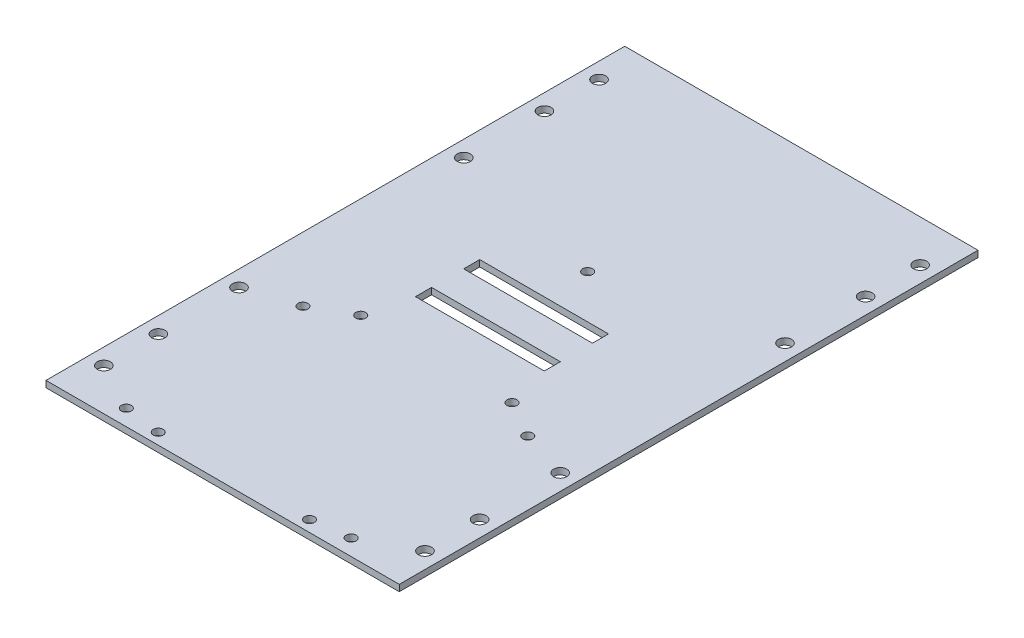
ISO-10303-21;
HEADER;
FILE_DESCRIPTION(('STEP AP214'),'2;1');
FILE_NAME('part.step','',(''),(''),'','','');
FILE_SCHEMA(('AUTOMOTIVE_DESIGN { 1 0 10303 214 1 1 1 1 }'));
ENDSEC;
DATA;
#1=APPLICATION_CONTEXT('core data for automotive mechanical design processes');
#2=APPLICATION_PROTOCOL_DEFINITION('international standard','automotive_design',2000,#1);
#3=PRODUCT_CONTEXT('',#1,'mechanical');
#4=PRODUCT('Part','Part','',(#3));
#5=PRODUCT_RELATED_PRODUCT_CATEGORY('part','',(#4));
#6=PRODUCT_DEFINITION_FORMATION('','',#4);
#7=PRODUCT_DEFINITION_CONTEXT('part definition',#1,'design');
#8=PRODUCT_DEFINITION('design','',#6,#7);
#9=PRODUCT_DEFINITION_SHAPE('','',#8);
#10=(LENGTH_UNIT() NAMED_UNIT(*) SI_UNIT(.MILLI.,.METRE.));
#11=(NAMED_UNIT(*) PLANE_ANGLE_UNIT() SI_UNIT($,.RADIAN.));
#12=(NAMED_UNIT(*) SI_UNIT($,.STERADIAN.) SOLID_ANGLE_UNIT());
#13=UNCERTAINTY_MEASURE_WITH_UNIT(LENGTH_MEASURE(1.E-05),#10,'distance_accuracy_value','');
#14=(GEOMETRIC_REPRESENTATION_CONTEXT(3) GLOBAL_UNCERTAINTY_ASSIGNED_CONTEXT((#13)) GLOBAL_UNIT_ASSIGNED_CONTEXT((#10,
#11,#12)) REPRESENTATION_CONTEXT('',''));
#15=CARTESIAN_POINT('',(0.,0.,0.));
#16=DIRECTION('',(0.,0.,1.));
#17=DIRECTION('',(1.,0.,0.));
#18=AXIS2_PLACEMENT_3D('',#15,#16,#17);
#19=CARTESIAN_POINT('',(0.,2.,0.));
#20=DIRECTION('',(0.,-1.,0.));
#21=DIRECTION('',(0.,0.,-1.));
#22=AXIS2_PLACEMENT_3D('',#19,#20,#21);
#23=PLANE('',#22);
#24=CARTESIAN_POINT('',(-1.01307850997046E-12,2.,-23.5500000000006));
#25=DIRECTION('',(0.,1.,0.));
#26=DIRECTION('',(0.,0.,1.));
#27=AXIS2_PLACEMENT_3D('',#24,#25,#26);
#28=CIRCLE('',#27,1.55);
#29=CARTESIAN_POINT('',(-1.01307850997046E-12,2.,-22.0000000000006));
#30=VERTEX_POINT('',#29);
#31=EDGE_CURVE('E536',#30,#30,#28,.T.);
#32=ORIENTED_EDGE('',*,*,#31,.F.);
#33=EDGE_LOOP('',(#32));
#34=FACE_BOUND('',#33,.T.);
#35=CARTESIAN_POINT('',(35.,2.,85.1));
#36=DIRECTION('',(0.,1.,0.));
#37=DIRECTION('',(0.,0.,1.));
#38=AXIS2_PLACEMENT_3D('',#35,#36,#37);
#39=CIRCLE('',#38,1.55);
#40=CARTESIAN_POINT('',(35.,2.,86.65));
#41=VERTEX_POINT('',#40);
#42=EDGE_CURVE('E538',#41,#41,#39,.T.);
#43=ORIENTED_EDGE('',*,*,#42,.F.);
#44=EDGE_LOOP('',(#43));
#45=FACE_BOUND('',#44,.T.);
#46=CARTESIAN_POINT('',(35.,2.,30.1));
#47=DIRECTION('',(0.,1.,0.));
#48=DIRECTION('',(0.,0.,1.));
#49=AXIS2_PLACEMENT_3D('',#46,#47,#48);
#50=CIRCLE('',#49,1.55);
#51=CARTESIAN_POINT('',(35.,2.,31.65));
#52=VERTEX_POINT('',#51);
#53=EDGE_CURVE('E541',#52,#52,#50,.T.);
#54=ORIENTED_EDGE('',*,*,#53,.F.);
#55=EDGE_LOOP('',(#54));
#56=FACE_BOUND('',#55,.T.);
#57=CARTESIAN_POINT('',(-35.,2.,85.1));
#58=DIRECTION('',(0.,1.,0.));
#59=DIRECTION('',(0.,0.,1.));
#60=AXIS2_PLACEMENT_3D('',#57,#58,#59);
#61=CIRCLE('',#60,1.55);
#62=CARTESIAN_POINT('',(-35.,2.,86.65));
#63=VERTEX_POINT('',#62);
#64=EDGE_CURVE('E544',#63,#63,#61,.T.);
#65=ORIENTED_EDGE('',*,*,#64,.F.);
#66=EDGE_LOOP('',(#65));
#67=FACE_BOUND('',#66,.T.);
#68=CARTESIAN_POINT('',(-23.5500000000008,2.,23.5499999999994));
#69=DIRECTION('',(0.,1.,0.));
#70=DIRECTION('',(0.,0.,1.));
#71=AXIS2_PLACEMENT_3D('',#68,#69,#70);
#72=CIRCLE('',#71,1.55);
#73=CARTESIAN_POINT('',(-23.5500000000008,2.,25.0999999999994));
#74=VERTEX_POINT('',#73);
#75=EDGE_CURVE('E527',#74,#74,#72,.T.);
#76=ORIENTED_EDGE('',*,*,#75,.F.);
#77=EDGE_LOOP('',(#76));
#78=FACE_BOUND('',#77,.T.);
#79=CARTESIAN_POINT('',(23.5499999999992,2.,86.5999999999997));
#80=DIRECTION('',(0.,1.,0.));
#81=DIRECTION('',(0.,0.,1.));
#82=AXIS2_PLACEMENT_3D('',#79,#80,#81);
#83=CIRCLE('',#82,1.55);
#84=CARTESIAN_POINT('',(23.5499999999992,2.,88.1499999999997));
#85=VERTEX_POINT('',#84);
#86=EDGE_CURVE('E524',#85,#85,#83,.T.);
#87=ORIENTED_EDGE('',*,*,#86,.F.);
#88=EDGE_LOOP('',(#87));
#89=FACE_BOUND('',#88,.T.);
#90=CARTESIAN_POINT('',(-23.5500000000008,2.,86.5999999999997));
#91=DIRECTION('',(0.,1.,0.));
#92=DIRECTION('',(0.,0.,1.));
#93=AXIS2_PLACEMENT_3D('',#90,#91,#92);
#94=CIRCLE('',#93,1.55);
#95=CARTESIAN_POINT('',(-23.5500000000008,2.,88.1499999999997));
#96=VERTEX_POINT('',#95);
#97=EDGE_CURVE('E526',#96,#96,#94,.T.);
#98=ORIENTED_EDGE('',*,*,#97,.F.);
#99=EDGE_LOOP('',(#98));
#100=FACE_BOUND('',#99,.T.);
#101=CARTESIAN_POINT('',(23.5499999999992,2.,23.5499999999994));
#102=DIRECTION('',(0.,1.,0.));
#103=DIRECTION('',(0.,0.,1.));
#104=AXIS2_PLACEMENT_3D('',#101,#102,#103);
#105=CIRCLE('',#104,1.55);
#106=CARTESIAN_POINT('',(23.5499999999992,2.,25.0999999999994));
#107=VERTEX_POINT('',#106);
#108=EDGE_CURVE('E530',#107,#107,#105,.T.);
#109=ORIENTED_EDGE('',*,*,#108,.F.);
#110=EDGE_LOOP('',(#109));
#111=FACE_BOUND('',#110,.T.);
#112=CARTESIAN_POINT('',(-35.,2.,30.1));
#113=DIRECTION('',(0.,1.,0.));
#114=DIRECTION('',(0.,0.,1.));
#115=AXIS2_PLACEMENT_3D('',#112,#113,#114);
#116=CIRCLE('',#115,1.55);
#117=CARTESIAN_POINT('',(-35.,2.,31.65));
#118=VERTEX_POINT('',#117);
#119=EDGE_CURVE('E302',#118,#118,#116,.T.);
#120=ORIENTED_EDGE('',*,*,#119,.F.);
#121=EDGE_LOOP('',(#120));
#122=FACE_BOUND('',#121,.T.);
#123=DIRECTION('',(1.,0.,0.));
#124=VECTOR('',#123,1.);
#125=CARTESIAN_POINT('',(-20.05,2.,-5.));
#126=LINE('',#125,#124);
#127=CARTESIAN_POINT('',(-20.05,2.,-5.));
#128=VERTEX_POINT('',#127);
#129=CARTESIAN_POINT('',(20.05,2.,-5.00000000000001));
#130=VERTEX_POINT('',#129);
#131=EDGE_CURVE('E148',#128,#130,#126,.T.);
#132=ORIENTED_EDGE('',*,*,#131,.F.);
#133=DIRECTION('',(0.,0.,1.));
#134=VECTOR('',#133,1.);
#135=CARTESIAN_POINT('',(-20.05,2.,-9.99999999999999));
#136=LINE('',#135,#134);
#137=CARTESIAN_POINT('',(-20.05,2.,-9.99999999999999));
#138=VERTEX_POINT('',#137);
#139=EDGE_CURVE('E58',#138,#128,#136,.T.);
#140=ORIENTED_EDGE('',*,*,#139,.F.);
#141=DIRECTION('',(-1.,0.,0.));
#142=VECTOR('',#141,1.);
#143=CARTESIAN_POINT('',(20.05,2.,-10.));
#144=LINE('',#143,#142);
#145=CARTESIAN_POINT('',(20.05,2.,-10.));
#146=VERTEX_POINT('',#145);
#147=EDGE_CURVE('E154',#146,#138,#144,.T.);
#148=ORIENTED_EDGE('',*,*,#147,.F.);
#149=DIRECTION('',(0.,0.,-1.));
#150=VECTOR('',#149,1.);
#151=CARTESIAN_POINT('',(20.05,2.,-5.00000000000001));
#152=LINE('',#151,#150);
#153=EDGE_CURVE('E138',#130,#146,#152,.T.);
#154=ORIENTED_EDGE('',*,*,#153,.F.);
#155=EDGE_LOOP('',(#132,#140,#148,#154));
#156=FACE_BOUND('',#155,.T.);
#157=DIRECTION('',(-1.,0.,0.));
#158=VECTOR('',#157,1.);
#159=CARTESIAN_POINT('',(-20.05,2.,5.00000000000001));
#160=LINE('',#159,#158);
#161=CARTESIAN_POINT('',(20.05,2.,5.));
#162=VERTEX_POINT('',#161);
#163=CARTESIAN_POINT('',(-20.05,2.,5.00000000000001));
#164=VERTEX_POINT('',#163);
#165=EDGE_CURVE('E178',#162,#164,#160,.T.);
#166=ORIENTED_EDGE('',*,*,#165,.F.);
#167=DIRECTION('',(0.,0.,-1.));
#168=VECTOR('',#167,1.);
#169=CARTESIAN_POINT('',(20.05,2.,10.));
#170=LINE('',#169,#168);
#171=CARTESIAN_POINT('',(20.05,2.,10.));
#172=VERTEX_POINT('',#171);
#173=EDGE_CURVE('E66',#172,#162,#170,.T.);
#174=ORIENTED_EDGE('',*,*,#173,.F.);
#175=DIRECTION('',(1.,0.,0.));
#176=VECTOR('',#175,1.);
#177=CARTESIAN_POINT('',(-20.05,2.,10.));
#178=LINE('',#177,#176);
#179=CARTESIAN_POINT('',(-20.05,2.,10.));
#180=VERTEX_POINT('',#179);
#181=EDGE_CURVE('E166',#180,#172,#178,.T.);
#182=ORIENTED_EDGE('',*,*,#181,.F.);
#183=DIRECTION('',(0.,0.,1.));
#184=VECTOR('',#183,1.);
#185=CARTESIAN_POINT('',(-20.05,2.,5.00000000000001));
#186=LINE('',#185,#184);
#187=EDGE_CURVE('E175',#164,#180,#186,.T.);
#188=ORIENTED_EDGE('',*,*,#187,.F.);
#189=EDGE_LOOP('',(#166,#174,#182,#188));
#190=FACE_BOUND('',#189,.T.);
#191=DIRECTION('',(-1.,0.,0.));
#192=VECTOR('',#191,1.);
#193=CARTESIAN_POINT('',(0.,2.,-90.1));
#194=LINE('',#193,#192);
#195=CARTESIAN_POINT('',(55.,2.,-90.1));
#196=VERTEX_POINT('',#195);
#197=CARTESIAN_POINT('',(-55.,2.,-90.1));
#198=VERTEX_POINT('',#197);
#199=EDGE_CURVE('E277',#196,#198,#194,.T.);
#200=ORIENTED_EDGE('',*,*,#199,.T.);
#201=DIRECTION('',(0.,0.,-1.));
#202=VECTOR('',#201,1.);
#203=CARTESIAN_POINT('',(-55.,2.,0.));
#204=LINE('',#203,#202);
#205=CARTESIAN_POINT('',(-55.,2.,90.1));
#206=VERTEX_POINT('',#205);
#207=EDGE_CURVE('E248',#206,#198,#204,.T.);
#208=ORIENTED_EDGE('',*,*,#207,.F.);
#209=DIRECTION('',(-1.,0.,0.));
#210=VECTOR('',#209,1.);
#211=CARTESIAN_POINT('',(0.,2.,90.1));
#212=LINE('',#211,#210);
#213=CARTESIAN_POINT('',(55.,2.,90.1));
#214=VERTEX_POINT('',#213);
#215=EDGE_CURVE('E221',#214,#206,#212,.T.);
#216=ORIENTED_EDGE('',*,*,#215,.F.);
#217=DIRECTION('',(0.,0.,-1.));
#218=VECTOR('',#217,1.);
#219=CARTESIAN_POINT('',(55.,2.,0.));
#220=LINE('',#219,#218);
#221=EDGE_CURVE('E275',#214,#196,#220,.T.);
#222=ORIENTED_EDGE('',*,*,#221,.T.);
#223=EDGE_LOOP('',(#200,#208,#216,#222));
#224=FACE_BOUND('',#223,.T.);
#225=CARTESIAN_POINT('',(50.,2.,-77.1));
#226=DIRECTION('',(0.,1.,0.));
#227=DIRECTION('',(0.,0.,1.));
#228=AXIS2_PLACEMENT_3D('',#225,#226,#227);
#229=CIRCLE('',#228,2.04999999999999);
#230=CARTESIAN_POINT('',(50.,2.,-75.05));
#231=VERTEX_POINT('',#230);
#232=EDGE_CURVE('E269',#231,#231,#229,.T.);
#233=ORIENTED_EDGE('',*,*,#232,.F.);
#234=EDGE_LOOP('',(#233));
#235=FACE_BOUND('',#234,.T.);
#236=CARTESIAN_POINT('',(50.,2.,-60.1));
#237=DIRECTION('',(0.,1.,0.));
#238=DIRECTION('',(0.,0.,1.));
#239=AXIS2_PLACEMENT_3D('',#236,#237,#238);
#240=CIRCLE('',#239,2.04999999999999);
#241=CARTESIAN_POINT('',(50.,2.,-58.05));
#242=VERTEX_POINT('',#241);
#243=EDGE_CURVE('E263',#242,#242,#240,.T.);
#244=ORIENTED_EDGE('',*,*,#243,.F.);
#245=EDGE_LOOP('',(#244));
#246=FACE_BOUND('',#245,.T.);
#247=CARTESIAN_POINT('',(50.,2.,-35.));
#248=DIRECTION('',(0.,1.,0.));
#249=DIRECTION('',(0.,0.,1.));
#250=AXIS2_PLACEMENT_3D('',#247,#248,#249);
#251=CIRCLE('',#250,2.04999999999999);
#252=CARTESIAN_POINT('',(50.,2.,-32.95));
#253=VERTEX_POINT('',#252);
#254=EDGE_CURVE('E257',#253,#253,#251,.T.);
#255=ORIENTED_EDGE('',*,*,#254,.F.);
#256=EDGE_LOOP('',(#255));
#257=FACE_BOUND('',#256,.T.);
#258=CARTESIAN_POINT('',(-50.,2.,-35.));
#259=DIRECTION('',(0.,-1.,0.));
#260=DIRECTION('',(0.,0.,1.));
#261=AXIS2_PLACEMENT_3D('',#258,#259,#260);
#262=CIRCLE('',#261,2.04999999999999);
#263=CARTESIAN_POINT('',(-50.,2.,-32.95));
#264=VERTEX_POINT('',#263);
#265=EDGE_CURVE('E230',#264,#264,#262,.T.);
#266=ORIENTED_EDGE('',*,*,#265,.T.);
#267=EDGE_LOOP('',(#266));
#268=FACE_BOUND('',#267,.T.);
#269=CARTESIAN_POINT('',(-50.,2.,-60.1));
#270=DIRECTION('',(0.,-1.,0.));
#271=DIRECTION('',(0.,0.,1.));
#272=AXIS2_PLACEMENT_3D('',#269,#270,#271);
#273=CIRCLE('',#272,2.04999999999999);
#274=CARTESIAN_POINT('',(-50.,2.,-58.05));
#275=VERTEX_POINT('',#274);
#276=EDGE_CURVE('E236',#275,#275,#273,.T.);
#277=ORIENTED_EDGE('',*,*,#276,.T.);
#278=EDGE_LOOP('',(#277));
#279=FACE_BOUND('',#278,.T.);
#280=CARTESIAN_POINT('',(-50.,2.,-77.1));
#281=DIRECTION('',(0.,-1.,0.));
#282=DIRECTION('',(0.,0.,1.));
#283=AXIS2_PLACEMENT_3D('',#280,#281,#282);
#284=CIRCLE('',#283,2.04999999999999);
#285=CARTESIAN_POINT('',(-50.,2.,-75.05));
#286=VERTEX_POINT('',#285);
#287=EDGE_CURVE('E242',#286,#286,#284,.T.);
#288=ORIENTED_EDGE('',*,*,#287,.T.);
#289=EDGE_LOOP('',(#288));
#290=FACE_BOUND('',#289,.T.);
#291=CARTESIAN_POINT('',(50.,2.,77.1));
#292=DIRECTION('',(0.,-1.,0.));
#293=DIRECTION('',(0.,0.,-1.));
#294=AXIS2_PLACEMENT_3D('',#291,#292,#293);
#295=CIRCLE('',#294,2.04999999999999);
#296=CARTESIAN_POINT('',(50.,2.,75.05));
#297=VERTEX_POINT('',#296);
#298=EDGE_CURVE('E215',#297,#297,#295,.T.);
#299=ORIENTED_EDGE('',*,*,#298,.T.);
#300=EDGE_LOOP('',(#299));
#301=FACE_BOUND('',#300,.T.);
#302=CARTESIAN_POINT('',(50.,2.,60.1));
#303=DIRECTION('',(0.,-1.,0.));
#304=DIRECTION('',(0.,0.,-1.));
#305=AXIS2_PLACEMENT_3D('',#302,#303,#304);
#306=CIRCLE('',#305,2.04999999999999);
#307=CARTESIAN_POINT('',(50.,2.,58.05));
#308=VERTEX_POINT('',#307);
#309=EDGE_CURVE('E209',#308,#308,#306,.T.);
#310=ORIENTED_EDGE('',*,*,#309,.T.);
#311=EDGE_LOOP('',(#310));
#312=FACE_BOUND('',#311,.T.);
#313=CARTESIAN_POINT('',(50.,2.,35.));
#314=DIRECTION('',(0.,-1.,0.));
#315=DIRECTION('',(0.,0.,-1.));
#316=AXIS2_PLACEMENT_3D('',#313,#314,#315);
#317=CIRCLE('',#316,2.04999999999999);
#318=CARTESIAN_POINT('',(50.,2.,32.95));
#319=VERTEX_POINT('',#318);
#320=EDGE_CURVE('E203',#319,#319,#317,.T.);
#321=ORIENTED_EDGE('',*,*,#320,.T.);
#322=EDGE_LOOP('',(#321));
#323=FACE_BOUND('',#322,.T.);
#324=CARTESIAN_POINT('',(-50.,2.,35.));
#325=DIRECTION('',(0.,1.,0.));
#326=DIRECTION('',(0.,0.,-1.));
#327=AXIS2_PLACEMENT_3D('',#324,#325,#326);
#328=CIRCLE('',#327,2.04999999999999);
#329=CARTESIAN_POINT('',(-50.,2.,32.95));
#330=VERTEX_POINT('',#329);
#331=EDGE_CURVE('E182',#330,#330,#328,.T.);
#332=ORIENTED_EDGE('',*,*,#331,.F.);
#333=EDGE_LOOP('',(#332));
#334=FACE_BOUND('',#333,.T.);
#335=CARTESIAN_POINT('',(-50.,2.,60.1));
#336=DIRECTION('',(0.,1.,0.));
#337=DIRECTION('',(0.,0.,-1.));
#338=AXIS2_PLACEMENT_3D('',#335,#336,#337);
#339=CIRCLE('',#338,2.04999999999999);
#340=CARTESIAN_POINT('',(-50.,2.,58.05));
#341=VERTEX_POINT('',#340);
#342=EDGE_CURVE('E188',#341,#341,#339,.T.);
#343=ORIENTED_EDGE('',*,*,#342,.F.);
#344=EDGE_LOOP('',(#343));
#345=FACE_BOUND('',#344,.T.);
#346=CARTESIAN_POINT('',(-50.,2.,77.1));
#347=DIRECTION('',(0.,1.,0.));
#348=DIRECTION('',(0.,0.,-1.));
#349=AXIS2_PLACEMENT_3D('',#346,#347,#348);
#350=CIRCLE('',#349,2.04999999999999);
#351=CARTESIAN_POINT('',(-50.,2.,75.05));
#352=VERTEX_POINT('',#351);
#353=EDGE_CURVE('E194',#352,#352,#350,.T.);
#354=ORIENTED_EDGE('',*,*,#353,.F.);
#355=EDGE_LOOP('',(#354));
#356=FACE_BOUND('',#355,.T.);
#357=ADVANCED_FACE('F41',(#34,#45,#56,#67,#78,#89,#100,#111,#122,#156,#190,#224,#235,#246,#257,
#268,#279,#290,#301,#312,#323,#334,#345,#356),#23,.F.);
#358=CARTESIAN_POINT('',(0.,0.,0.));
#359=DIRECTION('',(0.,-1.,0.));
#360=DIRECTION('',(0.,0.,-1.));
#361=AXIS2_PLACEMENT_3D('',#358,#359,#360);
#362=PLANE('',#361);
#363=CARTESIAN_POINT('',(-1.01307850997046E-12,0.,-23.5500000000006));
#364=DIRECTION('',(0.,-1.,0.));
#365=DIRECTION('',(0.,0.,-1.));
#366=AXIS2_PLACEMENT_3D('',#363,#364,#365);
#367=CIRCLE('',#366,1.55);
#368=CARTESIAN_POINT('',(-1.01307850997046E-12,0.,-25.1000000000006));
#369=VERTEX_POINT('',#368);
#370=EDGE_CURVE('E45',#369,#369,#367,.T.);
#371=ORIENTED_EDGE('',*,*,#370,.F.);
#372=EDGE_LOOP('',(#371));
#373=FACE_BOUND('',#372,.T.);
#374=CARTESIAN_POINT('',(35.,0.,85.1));
#375=DIRECTION('',(0.,-1.,0.));
#376=DIRECTION('',(0.,0.,-1.));
#377=AXIS2_PLACEMENT_3D('',#374,#375,#376);
#378=CIRCLE('',#377,1.55);
#379=CARTESIAN_POINT('',(35.,0.,83.55));
#380=VERTEX_POINT('',#379);
#381=EDGE_CURVE('E319',#380,#380,#378,.T.);
#382=ORIENTED_EDGE('',*,*,#381,.F.);
#383=EDGE_LOOP('',(#382));
#384=FACE_BOUND('',#383,.T.);
#385=CARTESIAN_POINT('',(35.,0.,30.1));
#386=DIRECTION('',(0.,-1.,0.));
#387=DIRECTION('',(0.,0.,-1.));
#388=AXIS2_PLACEMENT_3D('',#385,#386,#387);
#389=CIRCLE('',#388,1.55);
#390=CARTESIAN_POINT('',(35.,0.,28.55));
#391=VERTEX_POINT('',#390);
#392=EDGE_CURVE('E317',#391,#391,#389,.T.);
#393=ORIENTED_EDGE('',*,*,#392,.F.);
#394=EDGE_LOOP('',(#393));
#395=FACE_BOUND('',#394,.T.);
#396=CARTESIAN_POINT('',(-35.,0.,85.1));
#397=DIRECTION('',(0.,-1.,0.));
#398=DIRECTION('',(0.,0.,-1.));
#399=AXIS2_PLACEMENT_3D('',#396,#397,#398);
#400=CIRCLE('',#399,1.55);
#401=CARTESIAN_POINT('',(-35.,0.,83.55));
#402=VERTEX_POINT('',#401);
#403=EDGE_CURVE('E314',#402,#402,#400,.T.);
#404=ORIENTED_EDGE('',*,*,#403,.F.);
#405=EDGE_LOOP('',(#404));
#406=FACE_BOUND('',#405,.T.);
#407=CARTESIAN_POINT('',(-23.5500000000008,0.,23.5499999999994));
#408=DIRECTION('',(0.,-1.,0.));
#409=DIRECTION('',(0.,0.,-1.));
#410=AXIS2_PLACEMENT_3D('',#407,#408,#409);
#411=CIRCLE('',#410,1.55);
#412=CARTESIAN_POINT('',(-23.5500000000008,0.,21.9999999999994));
#413=VERTEX_POINT('',#412);
#414=EDGE_CURVE('E311',#413,#413,#411,.T.);
#415=ORIENTED_EDGE('',*,*,#414,.F.);
#416=EDGE_LOOP('',(#415));
#417=FACE_BOUND('',#416,.T.);
#418=CARTESIAN_POINT('',(23.5499999999992,0.,86.5999999999997));
#419=DIRECTION('',(0.,-1.,0.));
#420=DIRECTION('',(0.,0.,-1.));
#421=AXIS2_PLACEMENT_3D('',#418,#419,#420);
#422=CIRCLE('',#421,1.55);
#423=CARTESIAN_POINT('',(23.5499999999992,0.,85.0499999999997));
#424=VERTEX_POINT('',#423);
#425=EDGE_CURVE('E308',#424,#424,#422,.T.);
#426=ORIENTED_EDGE('',*,*,#425,.F.);
#427=EDGE_LOOP('',(#426));
#428=FACE_BOUND('',#427,.T.);
#429=CARTESIAN_POINT('',(-23.5500000000008,0.,86.5999999999997));
#430=DIRECTION('',(0.,-1.,0.));
#431=DIRECTION('',(0.,0.,-1.));
#432=AXIS2_PLACEMENT_3D('',#429,#430,#431);
#433=CIRCLE('',#432,1.55);
#434=CARTESIAN_POINT('',(-23.5500000000008,0.,85.0499999999997));
#435=VERTEX_POINT('',#434);
#436=EDGE_CURVE('E305',#435,#435,#433,.T.);
#437=ORIENTED_EDGE('',*,*,#436,.F.);
#438=EDGE_LOOP('',(#437));
#439=FACE_BOUND('',#438,.T.);
#440=CARTESIAN_POINT('',(23.5499999999992,0.,23.5499999999994));
#441=DIRECTION('',(0.,-1.,0.));
#442=DIRECTION('',(0.,0.,-1.));
#443=AXIS2_PLACEMENT_3D('',#440,#441,#442);
#444=CIRCLE('',#443,1.55);
#445=CARTESIAN_POINT('',(23.5499999999992,0.,21.9999999999994));
#446=VERTEX_POINT('',#445);
#447=EDGE_CURVE('E301',#446,#446,#444,.T.);
#448=ORIENTED_EDGE('',*,*,#447,.F.);
#449=EDGE_LOOP('',(#448));
#450=FACE_BOUND('',#449,.T.);
#451=CARTESIAN_POINT('',(-35.,0.,30.1));
#452=DIRECTION('',(0.,-1.,0.));
#453=DIRECTION('',(0.,0.,-1.));
#454=AXIS2_PLACEMENT_3D('',#451,#452,#453);
#455=CIRCLE('',#454,1.55);
#456=CARTESIAN_POINT('',(-35.,0.,28.55));
#457=VERTEX_POINT('',#456);
#458=EDGE_CURVE('E298',#457,#457,#455,.T.);
#459=ORIENTED_EDGE('',*,*,#458,.F.);
#460=EDGE_LOOP('',(#459));
#461=FACE_BOUND('',#460,.T.);
#462=DIRECTION('',(0.,0.,-1.));
#463=VECTOR('',#462,1.);
#464=CARTESIAN_POINT('',(-20.05,0.,0.));
#465=LINE('',#464,#463);
#466=CARTESIAN_POINT('',(-20.05,0.,-5.));
#467=VERTEX_POINT('',#466);
#468=CARTESIAN_POINT('',(-20.05,0.,-9.99999999999999));
#469=VERTEX_POINT('',#468);
#470=EDGE_CURVE('E11',#467,#469,#465,.T.);
#471=ORIENTED_EDGE('',*,*,#470,.F.);
#472=DIRECTION('',(-1.,0.,0.));
#473=VECTOR('',#472,1.);
#474=CARTESIAN_POINT('',(0.,0.,-5.));
#475=LINE('',#474,#473);
#476=CARTESIAN_POINT('',(20.05,0.,-5.00000000000001));
#477=VERTEX_POINT('',#476);
#478=EDGE_CURVE('E294',#477,#467,#475,.T.);
#479=ORIENTED_EDGE('',*,*,#478,.F.);
#480=DIRECTION('',(0.,0.,1.));
#481=VECTOR('',#480,1.);
#482=CARTESIAN_POINT('',(20.05,0.,0.));
#483=LINE('',#482,#481);
#484=CARTESIAN_POINT('',(20.05,0.,-10.));
#485=VERTEX_POINT('',#484);
#486=EDGE_CURVE('E141',#485,#477,#483,.T.);
#487=ORIENTED_EDGE('',*,*,#486,.F.);
#488=DIRECTION('',(1.,0.,0.));
#489=VECTOR('',#488,1.);
#490=CARTESIAN_POINT('',(0.,0.,-10.));
#491=LINE('',#490,#489);
#492=EDGE_CURVE('E50',#469,#485,#491,.T.);
#493=ORIENTED_EDGE('',*,*,#492,.F.);
#494=EDGE_LOOP('',(#471,#479,#487,#493));
#495=FACE_BOUND('',#494,.T.);
#496=DIRECTION('',(0.,0.,1.));
#497=VECTOR('',#496,1.);
#498=CARTESIAN_POINT('',(20.05,0.,0.));
#499=LINE('',#498,#497);
#500=CARTESIAN_POINT('',(20.05,0.,5.));
#501=VERTEX_POINT('',#500);
#502=CARTESIAN_POINT('',(20.05,0.,10.));
#503=VERTEX_POINT('',#502);
#504=EDGE_CURVE('E292',#501,#503,#499,.T.);
#505=ORIENTED_EDGE('',*,*,#504,.F.);
#506=DIRECTION('',(1.,0.,0.));
#507=VECTOR('',#506,1.);
#508=CARTESIAN_POINT('',(0.,0.,5.));
#509=LINE('',#508,#507);
#510=CARTESIAN_POINT('',(-20.05,0.,5.00000000000001));
#511=VERTEX_POINT('',#510);
#512=EDGE_CURVE('E285',#511,#501,#509,.T.);
#513=ORIENTED_EDGE('',*,*,#512,.F.);
#514=DIRECTION('',(0.,0.,-1.));
#515=VECTOR('',#514,1.);
#516=CARTESIAN_POINT('',(-20.05,0.,0.));
#517=LINE('',#516,#515);
#518=CARTESIAN_POINT('',(-20.05,0.,10.));
#519=VERTEX_POINT('',#518);
#520=EDGE_CURVE('E287',#519,#511,#517,.T.);
#521=ORIENTED_EDGE('',*,*,#520,.F.);
#522=DIRECTION('',(-1.,0.,0.));
#523=VECTOR('',#522,1.);
#524=CARTESIAN_POINT('',(0.,0.,10.));
#525=LINE('',#524,#523);
#526=EDGE_CURVE('E290',#503,#519,#525,.T.);
#527=ORIENTED_EDGE('',*,*,#526,.F.);
#528=EDGE_LOOP('',(#505,#513,#521,#527));
#529=FACE_BOUND('',#528,.T.);
#530=CARTESIAN_POINT('',(50.,0.,-60.1));
#531=DIRECTION('',(0.,1.,0.));
#532=DIRECTION('',(0.,0.,1.));
#533=AXIS2_PLACEMENT_3D('',#530,#531,#532);
#534=CIRCLE('',#533,2.04999999999999);
#535=CARTESIAN_POINT('',(50.,0.,-58.05));
#536=VERTEX_POINT('',#535);
#537=EDGE_CURVE('E260',#536,#536,#534,.T.);
#538=ORIENTED_EDGE('',*,*,#537,.T.);
#539=EDGE_LOOP('',(#538));
#540=FACE_BOUND('',#539,.T.);
#541=DIRECTION('',(0.,0.,-1.));
#542=VECTOR('',#541,1.);
#543=CARTESIAN_POINT('',(55.,0.,0.));
#544=LINE('',#543,#542);
#545=CARTESIAN_POINT('',(55.,0.,90.1));
#546=VERTEX_POINT('',#545);
#547=CARTESIAN_POINT('',(55.,0.,-90.1));
#548=VERTEX_POINT('',#547);
#549=EDGE_CURVE('E272',#546,#548,#544,.T.);
#550=ORIENTED_EDGE('',*,*,#549,.F.);
#551=DIRECTION('',(-1.,0.,0.));
#552=VECTOR('',#551,1.);
#553=CARTESIAN_POINT('',(0.,0.,90.1));
#554=LINE('',#553,#552);
#555=CARTESIAN_POINT('',(-55.,0.,90.1));
#556=VERTEX_POINT('',#555);
#557=EDGE_CURVE('E218',#546,#556,#554,.T.);
#558=ORIENTED_EDGE('',*,*,#557,.T.);
#559=DIRECTION('',(0.,0.,-1.));
#560=VECTOR('',#559,1.);
#561=CARTESIAN_POINT('',(-55.,0.,0.));
#562=LINE('',#561,#560);
#563=CARTESIAN_POINT('',(-55.,0.,-90.1));
#564=VERTEX_POINT('',#563);
#565=EDGE_CURVE('E245',#556,#564,#562,.T.);
#566=ORIENTED_EDGE('',*,*,#565,.T.);
#567=DIRECTION('',(-1.,0.,0.));
#568=VECTOR('',#567,1.);
#569=CARTESIAN_POINT('',(0.,0.,-90.1));
#570=LINE('',#569,#568);
#571=EDGE_CURVE('E278',#548,#564,#570,.T.);
#572=ORIENTED_EDGE('',*,*,#571,.F.);
#573=EDGE_LOOP('',(#550,#558,#566,#572));
#574=FACE_BOUND('',#573,.T.);
#575=CARTESIAN_POINT('',(50.,0.,-77.1));
#576=DIRECTION('',(0.,1.,0.));
#577=DIRECTION('',(0.,0.,1.));
#578=AXIS2_PLACEMENT_3D('',#575,#576,#577);
#579=CIRCLE('',#578,2.04999999999999);
#580=CARTESIAN_POINT('',(50.,0.,-75.05));
#581=VERTEX_POINT('',#580);
#582=EDGE_CURVE('E266',#581,#581,#579,.T.);
#583=ORIENTED_EDGE('',*,*,#582,.T.);
#584=EDGE_LOOP('',(#583));
#585=FACE_BOUND('',#584,.T.);
#586=CARTESIAN_POINT('',(50.,0.,-35.));
#587=DIRECTION('',(0.,1.,0.));
#588=DIRECTION('',(0.,0.,1.));
#589=AXIS2_PLACEMENT_3D('',#586,#587,#588);
#590=CIRCLE('',#589,2.04999999999999);
#591=CARTESIAN_POINT('',(50.,0.,-32.95));
#592=VERTEX_POINT('',#591);
#593=EDGE_CURVE('E256',#592,#592,#590,.T.);
#594=ORIENTED_EDGE('',*,*,#593,.T.);
#595=EDGE_LOOP('',(#594));
#596=FACE_BOUND('',#595,.T.);
#597=CARTESIAN_POINT('',(-50.,0.,-35.));
#598=DIRECTION('',(0.,-1.,0.));
#599=DIRECTION('',(0.,0.,1.));
#600=AXIS2_PLACEMENT_3D('',#597,#598,#599);
#601=CIRCLE('',#600,2.04999999999999);
#602=CARTESIAN_POINT('',(-50.,0.,-32.95));
#603=VERTEX_POINT('',#602);
#604=EDGE_CURVE('E229',#603,#603,#601,.T.);
#605=ORIENTED_EDGE('',*,*,#604,.F.);
#606=EDGE_LOOP('',(#605));
#607=FACE_BOUND('',#606,.T.);
#608=CARTESIAN_POINT('',(-50.,0.,-60.1));
#609=DIRECTION('',(0.,-1.,0.));
#610=DIRECTION('',(0.,0.,1.));
#611=AXIS2_PLACEMENT_3D('',#608,#609,#610);
#612=CIRCLE('',#611,2.04999999999999);
#613=CARTESIAN_POINT('',(-50.,0.,-58.05));
#614=VERTEX_POINT('',#613);
#615=EDGE_CURVE('E233',#614,#614,#612,.T.);
#616=ORIENTED_EDGE('',*,*,#615,.F.);
#617=EDGE_LOOP('',(#616));
#618=FACE_BOUND('',#617,.T.);
#619=CARTESIAN_POINT('',(-50.,0.,-77.1));
#620=DIRECTION('',(0.,-1.,0.));
#621=DIRECTION('',(0.,0.,1.));
#622=AXIS2_PLACEMENT_3D('',#619,#620,#621);
#623=CIRCLE('',#622,2.04999999999999);
#624=CARTESIAN_POINT('',(-50.,0.,-75.05));
#625=VERTEX_POINT('',#624);
#626=EDGE_CURVE('E239',#625,#625,#623,.T.);
#627=ORIENTED_EDGE('',*,*,#626,.F.);
#628=EDGE_LOOP('',(#627));
#629=FACE_BOUND('',#628,.T.);
#630=CARTESIAN_POINT('',(50.,0.,60.1));
#631=DIRECTION('',(0.,-1.,0.));
#632=DIRECTION('',(0.,0.,-1.));
#633=AXIS2_PLACEMENT_3D('',#630,#631,#632);
#634=CIRCLE('',#633,2.04999999999999);
#635=CARTESIAN_POINT('',(50.,0.,58.05));
#636=VERTEX_POINT('',#635);
#637=EDGE_CURVE('E206',#636,#636,#634,.T.);
#638=ORIENTED_EDGE('',*,*,#637,.F.);
#639=EDGE_LOOP('',(#638));
#640=FACE_BOUND('',#639,.T.);
#641=CARTESIAN_POINT('',(50.,0.,77.1));
#642=DIRECTION('',(0.,-1.,0.));
#643=DIRECTION('',(0.,0.,-1.));
#644=AXIS2_PLACEMENT_3D('',#641,#642,#643);
#645=CIRCLE('',#644,2.04999999999999);
#646=CARTESIAN_POINT('',(50.,0.,75.05));
#647=VERTEX_POINT('',#646);
#648=EDGE_CURVE('E212',#647,#647,#645,.T.);
#649=ORIENTED_EDGE('',*,*,#648,.F.);
#650=EDGE_LOOP('',(#649));
#651=FACE_BOUND('',#650,.T.);
#652=CARTESIAN_POINT('',(50.,0.,35.));
#653=DIRECTION('',(0.,-1.,0.));
#654=DIRECTION('',(0.,0.,-1.));
#655=AXIS2_PLACEMENT_3D('',#652,#653,#654);
#656=CIRCLE('',#655,2.04999999999999);
#657=CARTESIAN_POINT('',(50.,0.,32.95));
#658=VERTEX_POINT('',#657);
#659=EDGE_CURVE('E202',#658,#658,#656,.T.);
#660=ORIENTED_EDGE('',*,*,#659,.F.);
#661=EDGE_LOOP('',(#660));
#662=FACE_BOUND('',#661,.T.);
#663=CARTESIAN_POINT('',(-50.,0.,35.));
#664=DIRECTION('',(0.,1.,0.));
#665=DIRECTION('',(0.,0.,-1.));
#666=AXIS2_PLACEMENT_3D('',#663,#664,#665);
#667=CIRCLE('',#666,2.04999999999999);
#668=CARTESIAN_POINT('',(-50.,0.,32.95));
#669=VERTEX_POINT('',#668);
#670=EDGE_CURVE('E161',#669,#669,#667,.T.);
#671=ORIENTED_EDGE('',*,*,#670,.T.);
#672=EDGE_LOOP('',(#671));
#673=FACE_BOUND('',#672,.T.);
#674=CARTESIAN_POINT('',(-50.,0.,60.1));
#675=DIRECTION('',(0.,1.,0.));
#676=DIRECTION('',(0.,0.,-1.));
#677=AXIS2_PLACEMENT_3D('',#674,#675,#676);
#678=CIRCLE('',#677,2.04999999999999);
#679=CARTESIAN_POINT('',(-50.,0.,58.05));
#680=VERTEX_POINT('',#679);
#681=EDGE_CURVE('E185',#680,#680,#678,.T.);
#682=ORIENTED_EDGE('',*,*,#681,.T.);
#683=EDGE_LOOP('',(#682));
#684=FACE_BOUND('',#683,.T.);
#685=CARTESIAN_POINT('',(-50.,0.,77.1));
#686=DIRECTION('',(0.,1.,0.));
#687=DIRECTION('',(0.,0.,-1.));
#688=AXIS2_PLACEMENT_3D('',#685,#686,#687);
#689=CIRCLE('',#688,2.04999999999999);
#690=CARTESIAN_POINT('',(-50.,0.,75.05));
#691=VERTEX_POINT('',#690);
#692=EDGE_CURVE('E191',#691,#691,#689,.T.);
#693=ORIENTED_EDGE('',*,*,#692,.T.);
#694=EDGE_LOOP('',(#693));
#695=FACE_BOUND('',#694,.T.);
#696=ADVANCED_FACE('F329',(#373,#384,#395,#406,#417,#428,#439,#450,#461,#495,#529,#540,#574,
#585,#596,#607,#618,#629,#640,#651,#662,#673,#684,#695),#362,.T.);
#697=CARTESIAN_POINT('',(55.,2.,0.));
#698=DIRECTION('',(-1.,0.,0.));
#699=DIRECTION('',(0.,0.,1.));
#700=AXIS2_PLACEMENT_3D('',#697,#698,#699);
#701=PLANE('',#700);
#702=ORIENTED_EDGE('',*,*,#549,.T.);
#703=DIRECTION('',(0.,-1.,0.));
#704=VECTOR('',#703,1.);
#705=CARTESIAN_POINT('',(55.,2.,-90.1));
#706=LINE('',#705,#704);
#707=EDGE_CURVE('E280',#196,#548,#706,.T.);
#708=ORIENTED_EDGE('',*,*,#707,.F.);
#709=ORIENTED_EDGE('',*,*,#221,.F.);
#710=DIRECTION('',(0.,-1.,0.));
#711=VECTOR('',#710,1.);
#712=CARTESIAN_POINT('',(55.,2.,90.1));
#713=LINE('',#712,#711);
#714=EDGE_CURVE('E224',#214,#546,#713,.T.);
#715=ORIENTED_EDGE('',*,*,#714,.T.);
#716=EDGE_LOOP('',(#702,#708,#709,#715));
#717=FACE_BOUND('',#716,.T.);
#718=ADVANCED_FACE('F43',(#717),#701,.F.);
#719=CARTESIAN_POINT('',(0.,2.,-90.1));
#720=DIRECTION('',(0.,0.,1.));
#721=DIRECTION('',(1.,0.,0.));
#722=AXIS2_PLACEMENT_3D('',#719,#720,#721);
#723=PLANE('',#722);
#724=ORIENTED_EDGE('',*,*,#571,.T.);
#725=DIRECTION('',(0.,-1.,0.));
#726=VECTOR('',#725,1.);
#727=CARTESIAN_POINT('',(-55.,2.,-90.1));
#728=LINE('',#727,#726);
#729=EDGE_CURVE('E251',#198,#564,#728,.T.);
#730=ORIENTED_EDGE('',*,*,#729,.F.);
#731=ORIENTED_EDGE('',*,*,#199,.F.);
#732=ORIENTED_EDGE('',*,*,#707,.T.);
#733=EDGE_LOOP('',(#724,#730,#731,#732));
#734=FACE_BOUND('',#733,.T.);
#735=ADVANCED_FACE('F407',(#734),#723,.F.);
#736=CARTESIAN_POINT('',(50.,2.,-77.1));
#737=DIRECTION('',(0.,-1.,0.));
#738=DIRECTION('',(0.,0.,-1.));
#739=AXIS2_PLACEMENT_3D('',#736,#737,#738);
#740=CYLINDRICAL_SURFACE('',#739,2.04999999999999);
#741=ORIENTED_EDGE('',*,*,#232,.T.);
#742=EDGE_LOOP('',(#741));
#743=FACE_BOUND('',#742,.T.);
#744=ORIENTED_EDGE('',*,*,#582,.F.);
#745=EDGE_LOOP('',(#744));
#746=FACE_BOUND('',#745,.T.);
#747=ADVANCED_FACE('F405',(#743,#746),#740,.F.);
#748=CARTESIAN_POINT('',(50.,2.,-60.1));
#749=DIRECTION('',(0.,-1.,0.));
#750=DIRECTION('',(0.,0.,-1.));
#751=AXIS2_PLACEMENT_3D('',#748,#749,#750);
#752=CYLINDRICAL_SURFACE('',#751,2.04999999999999);
#753=ORIENTED_EDGE('',*,*,#243,.T.);
#754=EDGE_LOOP('',(#753));
#755=FACE_BOUND('',#754,.T.);
#756=ORIENTED_EDGE('',*,*,#537,.F.);
#757=EDGE_LOOP('',(#756));
#758=FACE_BOUND('',#757,.T.);
#759=ADVANCED_FACE('F414',(#755,#758),#752,.F.);
#760=CARTESIAN_POINT('',(50.,2.,-35.));
#761=DIRECTION('',(0.,-1.,0.));
#762=DIRECTION('',(0.,0.,-1.));
#763=AXIS2_PLACEMENT_3D('',#760,#761,#762);
#764=CYLINDRICAL_SURFACE('',#763,2.04999999999999);
#765=ORIENTED_EDGE('',*,*,#254,.T.);
#766=EDGE_LOOP('',(#765));
#767=FACE_BOUND('',#766,.T.);
#768=ORIENTED_EDGE('',*,*,#593,.F.);
#769=EDGE_LOOP('',(#768));
#770=FACE_BOUND('',#769,.T.);
#771=ADVANCED_FACE('F763',(#767,#770),#764,.F.);
#772=CARTESIAN_POINT('',(-55.,2.,0.));
#773=DIRECTION('',(-1.,0.,0.));
#774=DIRECTION('',(0.,0.,1.));
#775=AXIS2_PLACEMENT_3D('',#772,#773,#774);
#776=PLANE('',#775);
#777=ORIENTED_EDGE('',*,*,#565,.F.);
#778=DIRECTION('',(0.,-1.,0.));
#779=VECTOR('',#778,1.);
#780=CARTESIAN_POINT('',(-55.,2.,90.1));
#781=LINE('',#780,#779);
#782=EDGE_CURVE('E197',#206,#556,#781,.T.);
#783=ORIENTED_EDGE('',*,*,#782,.F.);
#784=ORIENTED_EDGE('',*,*,#207,.T.);
#785=ORIENTED_EDGE('',*,*,#729,.T.);
#786=EDGE_LOOP('',(#777,#783,#784,#785));
#787=FACE_BOUND('',#786,.T.);
#788=ADVANCED_FACE('F421',(#787),#776,.T.);
#789=CARTESIAN_POINT('',(-50.,2.,-77.1));
#790=DIRECTION('',(0.,-1.,0.));
#791=DIRECTION('',(0.,0.,-1.));
#792=AXIS2_PLACEMENT_3D('',#789,#790,#791);
#793=CYLINDRICAL_SURFACE('',#792,2.04999999999999);
#794=ORIENTED_EDGE('',*,*,#287,.F.);
#795=EDGE_LOOP('',(#794));
#796=FACE_BOUND('',#795,.T.);
#797=ORIENTED_EDGE('',*,*,#626,.T.);
#798=EDGE_LOOP('',(#797));
#799=FACE_BOUND('',#798,.T.);
#800=ADVANCED_FACE('F762',(#796,#799),#793,.F.);
#801=CARTESIAN_POINT('',(-50.,2.,-60.1));
#802=DIRECTION('',(0.,-1.,0.));
#803=DIRECTION('',(0.,0.,-1.));
#804=AXIS2_PLACEMENT_3D('',#801,#802,#803);
#805=CYLINDRICAL_SURFACE('',#804,2.04999999999999);
#806=ORIENTED_EDGE('',*,*,#276,.F.);
#807=EDGE_LOOP('',(#806));
#808=FACE_BOUND('',#807,.T.);
#809=ORIENTED_EDGE('',*,*,#615,.T.);
#810=EDGE_LOOP('',(#809));
#811=FACE_BOUND('',#810,.T.);
#812=ADVANCED_FACE('F782',(#808,#811),#805,.F.);
#813=CARTESIAN_POINT('',(-50.,2.,-35.));
#814=DIRECTION('',(0.,-1.,0.));
#815=DIRECTION('',(0.,0.,-1.));
#816=AXIS2_PLACEMENT_3D('',#813,#814,#815);
#817=CYLINDRICAL_SURFACE('',#816,2.04999999999999);
#818=ORIENTED_EDGE('',*,*,#265,.F.);
#819=EDGE_LOOP('',(#818));
#820=FACE_BOUND('',#819,.T.);
#821=ORIENTED_EDGE('',*,*,#604,.T.);
#822=EDGE_LOOP('',(#821));
#823=FACE_BOUND('',#822,.T.);
#824=ADVANCED_FACE('F750',(#820,#823),#817,.F.);
#825=CARTESIAN_POINT('',(0.,2.,90.1));
#826=DIRECTION('',(0.,0.,-1.));
#827=DIRECTION('',(1.,0.,0.));
#828=AXIS2_PLACEMENT_3D('',#825,#826,#827);
#829=PLANE('',#828);
#830=ORIENTED_EDGE('',*,*,#557,.F.);
#831=ORIENTED_EDGE('',*,*,#714,.F.);
#832=ORIENTED_EDGE('',*,*,#215,.T.);
#833=ORIENTED_EDGE('',*,*,#782,.T.);
#834=EDGE_LOOP('',(#830,#831,#832,#833));
#835=FACE_BOUND('',#834,.T.);
#836=ADVANCED_FACE('F426',(#835),#829,.F.);
#837=CARTESIAN_POINT('',(50.,2.,77.1));
#838=DIRECTION('',(0.,-1.,0.));
#839=DIRECTION('',(0.,0.,1.));
#840=AXIS2_PLACEMENT_3D('',#837,#838,#839);
#841=CYLINDRICAL_SURFACE('',#840,2.04999999999999);
#842=ORIENTED_EDGE('',*,*,#298,.F.);
#843=EDGE_LOOP('',(#842));
#844=FACE_BOUND('',#843,.T.);
#845=ORIENTED_EDGE('',*,*,#648,.T.);
#846=EDGE_LOOP('',(#845));
#847=FACE_BOUND('',#846,.T.);
#848=ADVANCED_FACE('F729',(#844,#847),#841,.F.);
#849=CARTESIAN_POINT('',(50.,2.,60.1));
#850=DIRECTION('',(0.,-1.,0.));
#851=DIRECTION('',(0.,0.,1.));
#852=AXIS2_PLACEMENT_3D('',#849,#850,#851);
#853=CYLINDRICAL_SURFACE('',#852,2.04999999999999);
#854=ORIENTED_EDGE('',*,*,#309,.F.);
#855=EDGE_LOOP('',(#854));
#856=FACE_BOUND('',#855,.T.);
#857=ORIENTED_EDGE('',*,*,#637,.T.);
#858=EDGE_LOOP('',(#857));
#859=FACE_BOUND('',#858,.T.);
#860=ADVANCED_FACE('F394',(#856,#859),#853,.F.);
#861=CARTESIAN_POINT('',(50.,2.,35.));
#862=DIRECTION('',(0.,-1.,0.));
#863=DIRECTION('',(0.,0.,1.));
#864=AXIS2_PLACEMENT_3D('',#861,#862,#863);
#865=CYLINDRICAL_SURFACE('',#864,2.04999999999999);
#866=ORIENTED_EDGE('',*,*,#320,.F.);
#867=EDGE_LOOP('',(#866));
#868=FACE_BOUND('',#867,.T.);
#869=ORIENTED_EDGE('',*,*,#659,.T.);
#870=EDGE_LOOP('',(#869));
#871=FACE_BOUND('',#870,.T.);
#872=ADVANCED_FACE('F384',(#868,#871),#865,.F.);
#873=CARTESIAN_POINT('',(-50.,2.,77.1));
#874=DIRECTION('',(0.,-1.,0.));
#875=DIRECTION('',(0.,0.,1.));
#876=AXIS2_PLACEMENT_3D('',#873,#874,#875);
#877=CYLINDRICAL_SURFACE('',#876,2.04999999999999);
#878=ORIENTED_EDGE('',*,*,#353,.T.);
#879=EDGE_LOOP('',(#878));
#880=FACE_BOUND('',#879,.T.);
#881=ORIENTED_EDGE('',*,*,#692,.F.);
#882=EDGE_LOOP('',(#881));
#883=FACE_BOUND('',#882,.T.);
#884=ADVANCED_FACE('F381',(#880,#883),#877,.F.);
#885=CARTESIAN_POINT('',(-50.,2.,60.1));
#886=DIRECTION('',(0.,-1.,0.));
#887=DIRECTION('',(0.,0.,1.));
#888=AXIS2_PLACEMENT_3D('',#885,#886,#887);
#889=CYLINDRICAL_SURFACE('',#888,2.04999999999999);
#890=ORIENTED_EDGE('',*,*,#342,.T.);
#891=EDGE_LOOP('',(#890));
#892=FACE_BOUND('',#891,.T.);
#893=ORIENTED_EDGE('',*,*,#681,.F.);
#894=EDGE_LOOP('',(#893));
#895=FACE_BOUND('',#894,.T.);
#896=ADVANCED_FACE('F383',(#892,#895),#889,.F.);
#897=CARTESIAN_POINT('',(-50.,2.,35.));
#898=DIRECTION('',(0.,-1.,0.));
#899=DIRECTION('',(0.,0.,1.));
#900=AXIS2_PLACEMENT_3D('',#897,#898,#899);
#901=CYLINDRICAL_SURFACE('',#900,2.04999999999999);
#902=ORIENTED_EDGE('',*,*,#331,.T.);
#903=EDGE_LOOP('',(#902));
#904=FACE_BOUND('',#903,.T.);
#905=ORIENTED_EDGE('',*,*,#670,.F.);
#906=EDGE_LOOP('',(#905));
#907=FACE_BOUND('',#906,.T.);
#908=ADVANCED_FACE('F391',(#904,#907),#901,.F.);
#909=CARTESIAN_POINT('',(20.05,-8.,10.));
#910=DIRECTION('',(1.,0.,0.));
#911=DIRECTION('',(0.,0.,-1.));
#912=AXIS2_PLACEMENT_3D('',#909,#910,#911);
#913=PLANE('',#912);
#914=ORIENTED_EDGE('',*,*,#504,.T.);
#915=DIRECTION('',(0.,1.,0.));
#916=VECTOR('',#915,1.);
#917=CARTESIAN_POINT('',(20.05,-8.,10.));
#918=LINE('',#917,#916);
#919=EDGE_CURVE('E171',#503,#172,#918,.T.);
#920=ORIENTED_EDGE('',*,*,#919,.T.);
#921=ORIENTED_EDGE('',*,*,#173,.T.);
#922=DIRECTION('',(0.,1.,0.));
#923=VECTOR('',#922,1.);
#924=CARTESIAN_POINT('',(20.05,-8.,5.));
#925=LINE('',#924,#923);
#926=EDGE_CURVE('E164',#501,#162,#925,.T.);
#927=ORIENTED_EDGE('',*,*,#926,.F.);
#928=EDGE_LOOP('',(#914,#920,#921,#927));
#929=FACE_BOUND('',#928,.T.);
#930=ADVANCED_FACE('F457',(#929),#913,.F.);
#931=CARTESIAN_POINT('',(-20.05,-8.,10.));
#932=DIRECTION('',(0.,0.,1.));
#933=DIRECTION('',(1.,0.,0.));
#934=AXIS2_PLACEMENT_3D('',#931,#932,#933);
#935=PLANE('',#934);
#936=ORIENTED_EDGE('',*,*,#526,.T.);
#937=DIRECTION('',(0.,1.,0.));
#938=VECTOR('',#937,1.);
#939=CARTESIAN_POINT('',(-20.05,-8.,10.));
#940=LINE('',#939,#938);
#941=EDGE_CURVE('E169',#519,#180,#940,.T.);
#942=ORIENTED_EDGE('',*,*,#941,.T.);
#943=ORIENTED_EDGE('',*,*,#181,.T.);
#944=ORIENTED_EDGE('',*,*,#919,.F.);
#945=EDGE_LOOP('',(#936,#942,#943,#944));
#946=FACE_BOUND('',#945,.T.);
#947=ADVANCED_FACE('F462',(#946),#935,.F.);
#948=CARTESIAN_POINT('',(-20.05,-8.,5.00000000000001));
#949=DIRECTION('',(-1.,0.,0.));
#950=DIRECTION('',(0.,0.,1.));
#951=AXIS2_PLACEMENT_3D('',#948,#949,#950);
#952=PLANE('',#951);
#953=ORIENTED_EDGE('',*,*,#520,.T.);
#954=DIRECTION('',(0.,1.,0.));
#955=VECTOR('',#954,1.);
#956=CARTESIAN_POINT('',(-20.05,-8.,5.00000000000001));
#957=LINE('',#956,#955);
#958=EDGE_CURVE('E167',#511,#164,#957,.T.);
#959=ORIENTED_EDGE('',*,*,#958,.T.);
#960=ORIENTED_EDGE('',*,*,#187,.T.);
#961=ORIENTED_EDGE('',*,*,#941,.F.);
#962=EDGE_LOOP('',(#953,#959,#960,#961));
#963=FACE_BOUND('',#962,.T.);
#964=ADVANCED_FACE('F467',(#963),#952,.F.);
#965=CARTESIAN_POINT('',(-20.05,-8.,5.00000000000001));
#966=DIRECTION('',(0.,0.,-1.));
#967=DIRECTION('',(-1.,0.,0.));
#968=AXIS2_PLACEMENT_3D('',#965,#966,#967);
#969=PLANE('',#968);
#970=ORIENTED_EDGE('',*,*,#512,.T.);
#971=ORIENTED_EDGE('',*,*,#926,.T.);
#972=ORIENTED_EDGE('',*,*,#165,.T.);
#973=ORIENTED_EDGE('',*,*,#958,.F.);
#974=EDGE_LOOP('',(#970,#971,#972,#973));
#975=FACE_BOUND('',#974,.T.);
#976=ADVANCED_FACE('F471',(#975),#969,.F.);
#977=CARTESIAN_POINT('',(-20.05,-8.,-9.99999999999999));
#978=DIRECTION('',(-1.,0.,0.));
#979=DIRECTION('',(0.,0.,1.));
#980=AXIS2_PLACEMENT_3D('',#977,#978,#979);
#981=PLANE('',#980);
#982=ORIENTED_EDGE('',*,*,#470,.T.);
#983=DIRECTION('',(0.,1.,0.));
#984=VECTOR('',#983,1.);
#985=CARTESIAN_POINT('',(-20.05,-8.,-9.99999999999999));
#986=LINE('',#985,#984);
#987=EDGE_CURVE('E159',#469,#138,#986,.T.);
#988=ORIENTED_EDGE('',*,*,#987,.T.);
#989=ORIENTED_EDGE('',*,*,#139,.T.);
#990=DIRECTION('',(0.,1.,0.));
#991=VECTOR('',#990,1.);
#992=CARTESIAN_POINT('',(-20.05,-8.,-5.));
#993=LINE('',#992,#991);
#994=EDGE_CURVE('E145',#467,#128,#993,.T.);
#995=ORIENTED_EDGE('',*,*,#994,.F.);
#996=EDGE_LOOP('',(#982,#988,#989,#995));
#997=FACE_BOUND('',#996,.T.);
#998=ADVANCED_FACE('F474',(#997),#981,.F.);
#999=CARTESIAN_POINT('',(20.05,-8.,-10.));
#1000=DIRECTION('',(0.,0.,-1.));
#1001=DIRECTION('',(-1.,0.,0.));
#1002=AXIS2_PLACEMENT_3D('',#999,#1000,#1001);
#1003=PLANE('',#1002);
#1004=ORIENTED_EDGE('',*,*,#492,.T.);
#1005=DIRECTION('',(0.,1.,0.));
#1006=VECTOR('',#1005,1.);
#1007=CARTESIAN_POINT('',(20.05,-8.,-10.));
#1008=LINE('',#1007,#1006);
#1009=EDGE_CURVE('E144',#485,#146,#1008,.T.);
#1010=ORIENTED_EDGE('',*,*,#1009,.T.);
#1011=ORIENTED_EDGE('',*,*,#147,.T.);
#1012=ORIENTED_EDGE('',*,*,#987,.F.);
#1013=EDGE_LOOP('',(#1004,#1010,#1011,#1012));
#1014=FACE_BOUND('',#1013,.T.);
#1015=ADVANCED_FACE('F479',(#1014),#1003,.F.);
#1016=CARTESIAN_POINT('',(20.05,-8.,-5.00000000000001));
#1017=DIRECTION('',(1.,0.,0.));
#1018=DIRECTION('',(0.,0.,-1.));
#1019=AXIS2_PLACEMENT_3D('',#1016,#1017,#1018);
#1020=PLANE('',#1019);
#1021=ORIENTED_EDGE('',*,*,#486,.T.);
#1022=DIRECTION('',(0.,1.,0.));
#1023=VECTOR('',#1022,1.);
#1024=CARTESIAN_POINT('',(20.05,-8.,-5.00000000000001));
#1025=LINE('',#1024,#1023);
#1026=EDGE_CURVE('E133',#477,#130,#1025,.T.);
#1027=ORIENTED_EDGE('',*,*,#1026,.T.);
#1028=ORIENTED_EDGE('',*,*,#153,.T.);
#1029=ORIENTED_EDGE('',*,*,#1009,.F.);
#1030=EDGE_LOOP('',(#1021,#1027,#1028,#1029));
#1031=FACE_BOUND('',#1030,.T.);
#1032=ADVANCED_FACE('F135',(#1031),#1020,.F.);
#1033=CARTESIAN_POINT('',(-20.05,-8.,-5.));
#1034=DIRECTION('',(0.,0.,1.));
#1035=DIRECTION('',(1.,0.,0.));
#1036=AXIS2_PLACEMENT_3D('',#1033,#1034,#1035);
#1037=PLANE('',#1036);
#1038=ORIENTED_EDGE('',*,*,#478,.T.);
#1039=ORIENTED_EDGE('',*,*,#994,.T.);
#1040=ORIENTED_EDGE('',*,*,#131,.T.);
#1041=ORIENTED_EDGE('',*,*,#1026,.F.);
#1042=EDGE_LOOP('',(#1038,#1039,#1040,#1041));
#1043=FACE_BOUND('',#1042,.T.);
#1044=ADVANCED_FACE('F149',(#1043),#1037,.F.);
#1045=CARTESIAN_POINT('',(-35.,-8.,30.1));
#1046=DIRECTION('',(0.,1.,0.));
#1047=DIRECTION('',(0.,0.,1.));
#1048=AXIS2_PLACEMENT_3D('',#1045,#1046,#1047);
#1049=CYLINDRICAL_SURFACE('',#1048,1.55);
#1050=ORIENTED_EDGE('',*,*,#458,.T.);
#1051=EDGE_LOOP('',(#1050));
#1052=FACE_BOUND('',#1051,.T.);
#1053=ORIENTED_EDGE('',*,*,#119,.T.);
#1054=EDGE_LOOP('',(#1053));
#1055=FACE_BOUND('',#1054,.T.);
#1056=ADVANCED_FACE('F482',(#1052,#1055),#1049,.F.);
#1057=CARTESIAN_POINT('',(23.5499999999992,-8.,23.5499999999994));
#1058=DIRECTION('',(0.,1.,0.));
#1059=DIRECTION('',(0.,0.,1.));
#1060=AXIS2_PLACEMENT_3D('',#1057,#1058,#1059);
#1061=CYLINDRICAL_SURFACE('',#1060,1.55);
#1062=ORIENTED_EDGE('',*,*,#447,.T.);
#1063=EDGE_LOOP('',(#1062));
#1064=FACE_BOUND('',#1063,.T.);
#1065=ORIENTED_EDGE('',*,*,#108,.T.);
#1066=EDGE_LOOP('',(#1065));
#1067=FACE_BOUND('',#1066,.T.);
#1068=ADVANCED_FACE('F490',(#1064,#1067),#1061,.F.);
#1069=CARTESIAN_POINT('',(-23.5500000000008,-8.,86.5999999999997));
#1070=DIRECTION('',(0.,1.,0.));
#1071=DIRECTION('',(0.,0.,1.));
#1072=AXIS2_PLACEMENT_3D('',#1069,#1070,#1071);
#1073=CYLINDRICAL_SURFACE('',#1072,1.55);
#1074=ORIENTED_EDGE('',*,*,#436,.T.);
#1075=EDGE_LOOP('',(#1074));
#1076=FACE_BOUND('',#1075,.T.);
#1077=ORIENTED_EDGE('',*,*,#97,.T.);
#1078=EDGE_LOOP('',(#1077));
#1079=FACE_BOUND('',#1078,.T.);
#1080=ADVANCED_FACE('F506',(#1076,#1079),#1073,.F.);
#1081=CARTESIAN_POINT('',(23.5499999999992,-8.,86.5999999999997));
#1082=DIRECTION('',(0.,1.,0.));
#1083=DIRECTION('',(0.,0.,1.));
#1084=AXIS2_PLACEMENT_3D('',#1081,#1082,#1083);
#1085=CYLINDRICAL_SURFACE('',#1084,1.55);
#1086=ORIENTED_EDGE('',*,*,#425,.T.);
#1087=EDGE_LOOP('',(#1086));
#1088=FACE_BOUND('',#1087,.T.);
#1089=ORIENTED_EDGE('',*,*,#86,.T.);
#1090=EDGE_LOOP('',(#1089));
#1091=FACE_BOUND('',#1090,.T.);
#1092=ADVANCED_FACE('F509',(#1088,#1091),#1085,.F.);
#1093=CARTESIAN_POINT('',(-23.5500000000008,-8.,23.5499999999994));
#1094=DIRECTION('',(0.,1.,0.));
#1095=DIRECTION('',(0.,0.,1.));
#1096=AXIS2_PLACEMENT_3D('',#1093,#1094,#1095);
#1097=CYLINDRICAL_SURFACE('',#1096,1.55);
#1098=ORIENTED_EDGE('',*,*,#414,.T.);
#1099=EDGE_LOOP('',(#1098));
#1100=FACE_BOUND('',#1099,.T.);
#1101=ORIENTED_EDGE('',*,*,#75,.T.);
#1102=EDGE_LOOP('',(#1101));
#1103=FACE_BOUND('',#1102,.T.);
#1104=ADVANCED_FACE('F500',(#1100,#1103),#1097,.F.);
#1105=CARTESIAN_POINT('',(-35.,-8.,85.1));
#1106=DIRECTION('',(0.,1.,0.));
#1107=DIRECTION('',(0.,0.,1.));
#1108=AXIS2_PLACEMENT_3D('',#1105,#1106,#1107);
#1109=CYLINDRICAL_SURFACE('',#1108,1.55);
#1110=ORIENTED_EDGE('',*,*,#403,.T.);
#1111=EDGE_LOOP('',(#1110));
#1112=FACE_BOUND('',#1111,.T.);
#1113=ORIENTED_EDGE('',*,*,#64,.T.);
#1114=EDGE_LOOP('',(#1113));
#1115=FACE_BOUND('',#1114,.T.);
#1116=ADVANCED_FACE('F496',(#1112,#1115),#1109,.F.);
#1117=CARTESIAN_POINT('',(35.,-8.,30.1));
#1118=DIRECTION('',(0.,1.,0.));
#1119=DIRECTION('',(0.,0.,1.));
#1120=AXIS2_PLACEMENT_3D('',#1117,#1118,#1119);
#1121=CYLINDRICAL_SURFACE('',#1120,1.55);
#1122=ORIENTED_EDGE('',*,*,#392,.T.);
#1123=EDGE_LOOP('',(#1122));
#1124=FACE_BOUND('',#1123,.T.);
#1125=ORIENTED_EDGE('',*,*,#53,.T.);
#1126=EDGE_LOOP('',(#1125));
#1127=FACE_BOUND('',#1126,.T.);
#1128=ADVANCED_FACE('F492',(#1124,#1127),#1121,.F.);
#1129=CARTESIAN_POINT('',(35.,-8.,85.1));
#1130=DIRECTION('',(0.,1.,0.));
#1131=DIRECTION('',(0.,0.,1.));
#1132=AXIS2_PLACEMENT_3D('',#1129,#1130,#1131);
#1133=CYLINDRICAL_SURFACE('',#1132,1.55);
#1134=ORIENTED_EDGE('',*,*,#381,.T.);
#1135=EDGE_LOOP('',(#1134));
#1136=FACE_BOUND('',#1135,.T.);
#1137=ORIENTED_EDGE('',*,*,#42,.T.);
#1138=EDGE_LOOP('',(#1137));
#1139=FACE_BOUND('',#1138,.T.);
#1140=ADVANCED_FACE('F495',(#1136,#1139),#1133,.F.);
#1141=CARTESIAN_POINT('',(-1.01307850997046E-12,-8.,-23.5500000000006));
#1142=DIRECTION('',(0.,1.,0.));
#1143=DIRECTION('',(0.,0.,1.));
#1144=AXIS2_PLACEMENT_3D('',#1141,#1142,#1143);
#1145=CYLINDRICAL_SURFACE('',#1144,1.55);
#1146=ORIENTED_EDGE('',*,*,#370,.T.);
#1147=EDGE_LOOP('',(#1146));
#1148=FACE_BOUND('',#1147,.T.);
#1149=ORIENTED_EDGE('',*,*,#31,.T.);
#1150=EDGE_LOOP('',(#1149));
#1151=FACE_BOUND('',#1150,.T.);
#1152=ADVANCED_FACE('F326',(#1148,#1151),#1145,.F.);
#1153=CLOSED_SHELL('',(#357,#696,#718,#735,#747,#759,#771,#788,#800,#812,#824,#836,#848,#860,
#872,#884,#896,#908,#930,#947,#964,#976,#998,#1015,#1032,#1044,#1056,#1068,#1080,#1092,#1104,
#1116,#1128,#1140,#1152));
#1154=MANIFOLD_SOLID_BREP('B2',#1153);
#1155=ADVANCED_BREP_SHAPE_REPRESENTATION('',(#18,#1154),#14);
#1156=SHAPE_DEFINITION_REPRESENTATION(#9,#1155);
ENDSEC;
END-ISO-10303-21;
